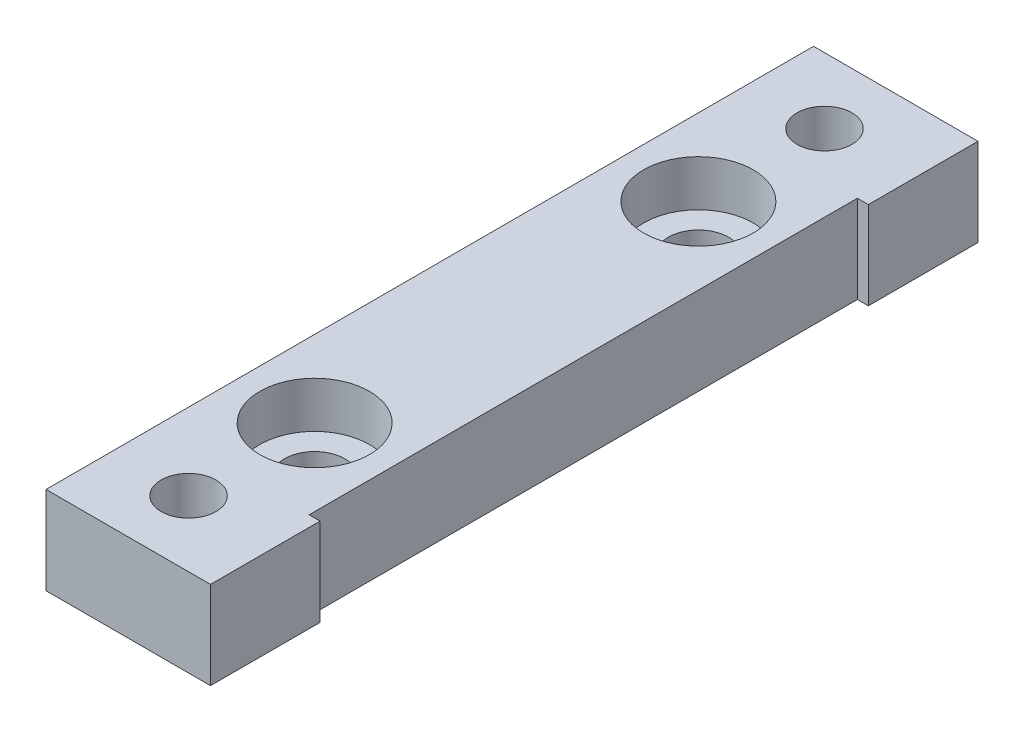
ISO-10303-21;
HEADER;
FILE_DESCRIPTION(('STEP AP214'),'2;1');
FILE_NAME('part.step','',(''),(''),'','','');
FILE_SCHEMA(('AUTOMOTIVE_DESIGN { 1 0 10303 214 1 1 1 1 }'));
ENDSEC;
DATA;
#1=APPLICATION_CONTEXT('core data for automotive mechanical design processes');
#2=APPLICATION_PROTOCOL_DEFINITION('international standard','automotive_design',2000,#1);
#3=PRODUCT_CONTEXT('',#1,'mechanical');
#4=PRODUCT('Part','Part','',(#3));
#5=PRODUCT_RELATED_PRODUCT_CATEGORY('part','',(#4));
#6=PRODUCT_DEFINITION_FORMATION('','',#4);
#7=PRODUCT_DEFINITION_CONTEXT('part definition',#1,'design');
#8=PRODUCT_DEFINITION('design','',#6,#7);
#9=PRODUCT_DEFINITION_SHAPE('','',#8);
#10=(LENGTH_UNIT() NAMED_UNIT(*) SI_UNIT(.MILLI.,.METRE.));
#11=(NAMED_UNIT(*) PLANE_ANGLE_UNIT() SI_UNIT($,.RADIAN.));
#12=(NAMED_UNIT(*) SI_UNIT($,.STERADIAN.) SOLID_ANGLE_UNIT());
#13=UNCERTAINTY_MEASURE_WITH_UNIT(LENGTH_MEASURE(1.E-05),#10,'distance_accuracy_value','');
#14=(GEOMETRIC_REPRESENTATION_CONTEXT(3) GLOBAL_UNCERTAINTY_ASSIGNED_CONTEXT((#13)) GLOBAL_UNIT_ASSIGNED_CONTEXT((#10,
#11,#12)) REPRESENTATION_CONTEXT('',''));
#15=CARTESIAN_POINT('',(0.,0.,0.));
#16=DIRECTION('',(0.,0.,1.));
#17=DIRECTION('',(1.,0.,0.));
#18=AXIS2_PLACEMENT_3D('',#15,#16,#17);
#19=CARTESIAN_POINT('',(-0.500000000000005,0.,-17.5));
#20=DIRECTION('',(0.,1.,0.));
#21=DIRECTION('',(0.,0.,1.));
#22=AXIS2_PLACEMENT_3D('',#19,#20,#21);
#23=CYLINDRICAL_SURFACE('',#22,2.75);
#24=CARTESIAN_POINT('',(-0.500000000000005,0.,-17.5));
#25=DIRECTION('',(0.,1.,0.));
#26=DIRECTION('',(0.,0.,1.));
#27=AXIS2_PLACEMENT_3D('',#24,#25,#26);
#28=CIRCLE('',#27,2.75);
#29=CARTESIAN_POINT('',(-0.500000000000005,0.,-14.75));
#30=VERTEX_POINT('',#29);
#31=EDGE_CURVE('E153',#30,#30,#28,.T.);
#32=ORIENTED_EDGE('',*,*,#31,.F.);
#33=EDGE_LOOP('',(#32));
#34=FACE_BOUND('',#33,.T.);
#35=CARTESIAN_POINT('',(-0.500000000000005,3.8,-17.5));
#36=DIRECTION('',(0.,1.,0.));
#37=DIRECTION('',(0.,0.,1.));
#38=AXIS2_PLACEMENT_3D('',#35,#36,#37);
#39=CIRCLE('',#38,2.75);
#40=CARTESIAN_POINT('',(-0.500000000000005,3.8,-14.75));
#41=VERTEX_POINT('',#40);
#42=EDGE_CURVE('E37',#41,#41,#39,.F.);
#43=ORIENTED_EDGE('',*,*,#42,.F.);
#44=EDGE_LOOP('',(#43));
#45=FACE_BOUND('',#44,.T.);
#46=ADVANCED_FACE('F33',(#34,#45),#23,.F.);
#47=CARTESIAN_POINT('',(-0.500000000000004,0.,17.5));
#48=DIRECTION('',(0.,1.,0.));
#49=DIRECTION('',(0.,0.,1.));
#50=AXIS2_PLACEMENT_3D('',#47,#48,#49);
#51=CYLINDRICAL_SURFACE('',#50,2.75);
#52=CARTESIAN_POINT('',(-0.500000000000004,0.,17.5));
#53=DIRECTION('',(0.,1.,0.));
#54=DIRECTION('',(0.,0.,1.));
#55=AXIS2_PLACEMENT_3D('',#52,#53,#54);
#56=CIRCLE('',#55,2.75);
#57=CARTESIAN_POINT('',(-0.500000000000004,0.,20.25));
#58=VERTEX_POINT('',#57);
#59=EDGE_CURVE('E168',#58,#58,#56,.T.);
#60=ORIENTED_EDGE('',*,*,#59,.F.);
#61=EDGE_LOOP('',(#60));
#62=FACE_BOUND('',#61,.T.);
#63=CARTESIAN_POINT('',(-0.500000000000004,3.8,17.5));
#64=DIRECTION('',(0.,1.,0.));
#65=DIRECTION('',(0.,0.,1.));
#66=AXIS2_PLACEMENT_3D('',#63,#64,#65);
#67=CIRCLE('',#66,2.75);
#68=CARTESIAN_POINT('',(-0.500000000000004,3.8,20.25));
#69=VERTEX_POINT('',#68);
#70=EDGE_CURVE('E147',#69,#69,#67,.F.);
#71=ORIENTED_EDGE('',*,*,#70,.F.);
#72=EDGE_LOOP('',(#71));
#73=FACE_BOUND('',#72,.T.);
#74=ADVANCED_FACE('F227',(#62,#73),#51,.F.);
#75=CARTESIAN_POINT('',(7.5,8.,-35.));
#76=DIRECTION('',(-1.,0.,0.));
#77=DIRECTION('',(0.,0.,1.));
#78=AXIS2_PLACEMENT_3D('',#75,#76,#77);
#79=PLANE('',#78);
#80=DIRECTION('',(0.,0.,-1.));
#81=VECTOR('',#80,1.);
#82=CARTESIAN_POINT('',(7.5,0.,-35.));
#83=LINE('',#82,#81);
#84=CARTESIAN_POINT('',(7.5,0.,35.));
#85=VERTEX_POINT('',#84);
#86=CARTESIAN_POINT('',(7.50000000000001,0.,25.));
#87=VERTEX_POINT('',#86);
#88=EDGE_CURVE('E128',#85,#87,#83,.T.);
#89=ORIENTED_EDGE('',*,*,#88,.T.);
#90=DIRECTION('',(0.,1.,0.));
#91=VECTOR('',#90,1.);
#92=CARTESIAN_POINT('',(7.50000000000001,0.,25.));
#93=LINE('',#92,#91);
#94=CARTESIAN_POINT('',(7.50000000000001,8.,25.));
#95=VERTEX_POINT('',#94);
#96=EDGE_CURVE('E129',#87,#95,#93,.T.);
#97=ORIENTED_EDGE('',*,*,#96,.T.);
#98=DIRECTION('',(0.,0.,-1.));
#99=VECTOR('',#98,1.);
#100=CARTESIAN_POINT('',(7.5,8.,-35.));
#101=LINE('',#100,#99);
#102=CARTESIAN_POINT('',(7.5,8.,35.));
#103=VERTEX_POINT('',#102);
#104=EDGE_CURVE('E196',#103,#95,#101,.T.);
#105=ORIENTED_EDGE('',*,*,#104,.F.);
#106=DIRECTION('',(0.,-1.,0.));
#107=VECTOR('',#106,1.);
#108=CARTESIAN_POINT('',(7.5,8.,35.));
#109=LINE('',#108,#107);
#110=EDGE_CURVE('E142',#103,#85,#109,.T.);
#111=ORIENTED_EDGE('',*,*,#110,.T.);
#112=EDGE_LOOP('',(#89,#97,#105,#111));
#113=FACE_BOUND('',#112,.T.);
#114=ADVANCED_FACE('F211',(#113),#79,.F.);
#115=CARTESIAN_POINT('',(7.5,8.,-25.));
#116=VERTEX_POINT('',#115);
#117=CARTESIAN_POINT('',(7.5,8.,-35.));
#118=VERTEX_POINT('',#117);
#119=EDGE_CURVE('E87',#116,#118,#101,.T.);
#120=ORIENTED_EDGE('',*,*,#119,.F.);
#121=DIRECTION('',(0.,1.,0.));
#122=VECTOR('',#121,1.);
#123=CARTESIAN_POINT('',(7.5,0.,-25.));
#124=LINE('',#123,#122);
#125=CARTESIAN_POINT('',(7.5,0.,-25.));
#126=VERTEX_POINT('',#125);
#127=EDGE_CURVE('E113',#126,#116,#124,.T.);
#128=ORIENTED_EDGE('',*,*,#127,.F.);
#129=CARTESIAN_POINT('',(7.5,0.,-35.));
#130=VERTEX_POINT('',#129);
#131=EDGE_CURVE('E121',#126,#130,#83,.T.);
#132=ORIENTED_EDGE('',*,*,#131,.T.);
#133=DIRECTION('',(0.,-1.,0.));
#134=VECTOR('',#133,1.);
#135=CARTESIAN_POINT('',(7.5,8.,-35.));
#136=LINE('',#135,#134);
#137=EDGE_CURVE('E11',#118,#130,#136,.T.);
#138=ORIENTED_EDGE('',*,*,#137,.F.);
#139=EDGE_LOOP('',(#120,#128,#132,#138));
#140=FACE_BOUND('',#139,.T.);
#141=ADVANCED_FACE('F35',(#140),#79,.F.);
#142=CARTESIAN_POINT('',(-7.5,8.,-35.));
#143=DIRECTION('',(0.,0.,1.));
#144=DIRECTION('',(1.,0.,0.));
#145=AXIS2_PLACEMENT_3D('',#142,#143,#144);
#146=PLANE('',#145);
#147=DIRECTION('',(-1.,0.,0.));
#148=VECTOR('',#147,1.);
#149=CARTESIAN_POINT('',(-7.5,0.,-35.));
#150=LINE('',#149,#148);
#151=CARTESIAN_POINT('',(-7.5,0.,-35.));
#152=VERTEX_POINT('',#151);
#153=EDGE_CURVE('E127',#130,#152,#150,.T.);
#154=ORIENTED_EDGE('',*,*,#153,.T.);
#155=DIRECTION('',(0.,-1.,0.));
#156=VECTOR('',#155,1.);
#157=CARTESIAN_POINT('',(-7.5,8.,-35.));
#158=LINE('',#157,#156);
#159=CARTESIAN_POINT('',(-7.5,8.,-35.));
#160=VERTEX_POINT('',#159);
#161=EDGE_CURVE('E42',#160,#152,#158,.T.);
#162=ORIENTED_EDGE('',*,*,#161,.F.);
#163=DIRECTION('',(-1.,0.,0.));
#164=VECTOR('',#163,1.);
#165=CARTESIAN_POINT('',(-7.5,8.,-35.));
#166=LINE('',#165,#164);
#167=EDGE_CURVE('E198',#118,#160,#166,.T.);
#168=ORIENTED_EDGE('',*,*,#167,.F.);
#169=ORIENTED_EDGE('',*,*,#137,.T.);
#170=EDGE_LOOP('',(#154,#162,#168,#169));
#171=FACE_BOUND('',#170,.T.);
#172=ADVANCED_FACE('F266',(#171),#146,.F.);
#173=CARTESIAN_POINT('',(-7.5,8.,-35.));
#174=DIRECTION('',(1.,0.,0.));
#175=DIRECTION('',(0.,0.,-1.));
#176=AXIS2_PLACEMENT_3D('',#173,#174,#175);
#177=PLANE('',#176);
#178=DIRECTION('',(0.,0.,1.));
#179=VECTOR('',#178,1.);
#180=CARTESIAN_POINT('',(-7.5,0.,-35.));
#181=LINE('',#180,#179);
#182=CARTESIAN_POINT('',(-7.5,0.,35.));
#183=VERTEX_POINT('',#182);
#184=EDGE_CURVE('E139',#152,#183,#181,.T.);
#185=ORIENTED_EDGE('',*,*,#184,.T.);
#186=DIRECTION('',(0.,-1.,0.));
#187=VECTOR('',#186,1.);
#188=CARTESIAN_POINT('',(-7.5,8.,35.));
#189=LINE('',#188,#187);
#190=CARTESIAN_POINT('',(-7.5,8.,35.));
#191=VERTEX_POINT('',#190);
#192=EDGE_CURVE('E144',#191,#183,#189,.T.);
#193=ORIENTED_EDGE('',*,*,#192,.F.);
#194=DIRECTION('',(0.,0.,1.));
#195=VECTOR('',#194,1.);
#196=CARTESIAN_POINT('',(-7.5,8.,-35.));
#197=LINE('',#196,#195);
#198=EDGE_CURVE('E199',#160,#191,#197,.T.);
#199=ORIENTED_EDGE('',*,*,#198,.F.);
#200=ORIENTED_EDGE('',*,*,#161,.T.);
#201=EDGE_LOOP('',(#185,#193,#199,#200));
#202=FACE_BOUND('',#201,.T.);
#203=ADVANCED_FACE('F206',(#202),#177,.F.);
#204=CARTESIAN_POINT('',(-7.5,8.,35.));
#205=DIRECTION('',(0.,0.,-1.));
#206=DIRECTION('',(-1.,0.,0.));
#207=AXIS2_PLACEMENT_3D('',#204,#205,#206);
#208=PLANE('',#207);
#209=DIRECTION('',(1.,0.,0.));
#210=VECTOR('',#209,1.);
#211=CARTESIAN_POINT('',(-7.5,0.,35.));
#212=LINE('',#211,#210);
#213=EDGE_CURVE('E80',#183,#85,#212,.T.);
#214=ORIENTED_EDGE('',*,*,#213,.T.);
#215=ORIENTED_EDGE('',*,*,#110,.F.);
#216=DIRECTION('',(1.,0.,0.));
#217=VECTOR('',#216,1.);
#218=CARTESIAN_POINT('',(-7.5,8.,35.));
#219=LINE('',#218,#217);
#220=EDGE_CURVE('E59',#191,#103,#219,.T.);
#221=ORIENTED_EDGE('',*,*,#220,.F.);
#222=ORIENTED_EDGE('',*,*,#192,.T.);
#223=EDGE_LOOP('',(#214,#215,#221,#222));
#224=FACE_BOUND('',#223,.T.);
#225=ADVANCED_FACE('F207',(#224),#208,.F.);
#226=CARTESIAN_POINT('',(0.,8.,0.));
#227=DIRECTION('',(0.,1.,0.));
#228=DIRECTION('',(0.,0.,1.));
#229=AXIS2_PLACEMENT_3D('',#226,#227,#228);
#230=PLANE('',#229);
#231=CARTESIAN_POINT('',(-0.500000000000005,8.,-17.5));
#232=DIRECTION('',(0.,1.,0.));
#233=DIRECTION('',(0.,0.,1.));
#234=AXIS2_PLACEMENT_3D('',#231,#232,#233);
#235=CIRCLE('',#234,5.);
#236=CARTESIAN_POINT('',(-0.500000000000005,8.,-12.5));
#237=VERTEX_POINT('',#236);
#238=EDGE_CURVE('E155',#237,#237,#235,.T.);
#239=ORIENTED_EDGE('',*,*,#238,.F.);
#240=EDGE_LOOP('',(#239));
#241=FACE_BOUND('',#240,.T.);
#242=CARTESIAN_POINT('',(-0.500000000000004,8.,17.5));
#243=DIRECTION('',(0.,1.,0.));
#244=DIRECTION('',(0.,0.,1.));
#245=AXIS2_PLACEMENT_3D('',#242,#243,#244);
#246=CIRCLE('',#245,5.);
#247=CARTESIAN_POINT('',(-0.500000000000004,8.,22.5));
#248=VERTEX_POINT('',#247);
#249=EDGE_CURVE('E165',#248,#248,#246,.T.);
#250=ORIENTED_EDGE('',*,*,#249,.F.);
#251=EDGE_LOOP('',(#250));
#252=FACE_BOUND('',#251,.T.);
#253=CARTESIAN_POINT('',(-0.500000000000004,8.,29.));
#254=DIRECTION('',(0.,1.,0.));
#255=DIRECTION('',(0.,0.,1.));
#256=AXIS2_PLACEMENT_3D('',#253,#254,#255);
#257=CIRCLE('',#256,2.5);
#258=CARTESIAN_POINT('',(-0.500000000000004,8.,31.5));
#259=VERTEX_POINT('',#258);
#260=EDGE_CURVE('E178',#259,#259,#257,.T.);
#261=ORIENTED_EDGE('',*,*,#260,.F.);
#262=EDGE_LOOP('',(#261));
#263=FACE_BOUND('',#262,.T.);
#264=CARTESIAN_POINT('',(-0.500000000000004,8.,-29.));
#265=DIRECTION('',(0.,1.,0.));
#266=DIRECTION('',(0.,0.,1.));
#267=AXIS2_PLACEMENT_3D('',#264,#265,#266);
#268=CIRCLE('',#267,2.5);
#269=CARTESIAN_POINT('',(-0.500000000000004,8.,-26.5));
#270=VERTEX_POINT('',#269);
#271=EDGE_CURVE('E171',#270,#270,#268,.T.);
#272=ORIENTED_EDGE('',*,*,#271,.F.);
#273=EDGE_LOOP('',(#272));
#274=FACE_BOUND('',#273,.T.);
#275=DIRECTION('',(1.,0.,0.));
#276=VECTOR('',#275,1.);
#277=CARTESIAN_POINT('',(7.50000000000001,8.,25.));
#278=LINE('',#277,#276);
#279=CARTESIAN_POINT('',(6.50000000000001,8.,25.));
#280=VERTEX_POINT('',#279);
#281=EDGE_CURVE('E117',#280,#95,#278,.T.);
#282=ORIENTED_EDGE('',*,*,#281,.F.);
#283=DIRECTION('',(0.,0.,1.));
#284=VECTOR('',#283,1.);
#285=CARTESIAN_POINT('',(6.5,8.,-25.));
#286=LINE('',#285,#284);
#287=CARTESIAN_POINT('',(6.5,8.,-25.));
#288=VERTEX_POINT('',#287);
#289=EDGE_CURVE('E190',#288,#280,#286,.T.);
#290=ORIENTED_EDGE('',*,*,#289,.F.);
#291=DIRECTION('',(-1.,0.,0.));
#292=VECTOR('',#291,1.);
#293=CARTESIAN_POINT('',(7.5,8.,-25.));
#294=LINE('',#293,#292);
#295=EDGE_CURVE('E177',#116,#288,#294,.T.);
#296=ORIENTED_EDGE('',*,*,#295,.F.);
#297=ORIENTED_EDGE('',*,*,#119,.T.);
#298=ORIENTED_EDGE('',*,*,#167,.T.);
#299=ORIENTED_EDGE('',*,*,#198,.T.);
#300=ORIENTED_EDGE('',*,*,#220,.T.);
#301=ORIENTED_EDGE('',*,*,#104,.T.);
#302=EDGE_LOOP('',(#282,#290,#296,#297,#298,#299,#300,#301));
#303=FACE_BOUND('',#302,.T.);
#304=ADVANCED_FACE('F203',(#241,#252,#263,#274,#303),#230,.T.);
#305=CARTESIAN_POINT('',(0.,0.,0.));
#306=DIRECTION('',(0.,1.,0.));
#307=DIRECTION('',(0.,0.,1.));
#308=AXIS2_PLACEMENT_3D('',#305,#306,#307);
#309=PLANE('',#308);
#310=ORIENTED_EDGE('',*,*,#59,.T.);
#311=EDGE_LOOP('',(#310));
#312=FACE_BOUND('',#311,.T.);
#313=ORIENTED_EDGE('',*,*,#31,.T.);
#314=EDGE_LOOP('',(#313));
#315=FACE_BOUND('',#314,.T.);
#316=CARTESIAN_POINT('',(-0.500000000000004,0.,29.));
#317=DIRECTION('',(0.,1.,0.));
#318=DIRECTION('',(0.,0.,1.));
#319=AXIS2_PLACEMENT_3D('',#316,#317,#318);
#320=CIRCLE('',#319,2.5);
#321=CARTESIAN_POINT('',(-0.500000000000004,0.,31.5));
#322=VERTEX_POINT('',#321);
#323=EDGE_CURVE('E174',#322,#322,#320,.T.);
#324=ORIENTED_EDGE('',*,*,#323,.T.);
#325=EDGE_LOOP('',(#324));
#326=FACE_BOUND('',#325,.T.);
#327=CARTESIAN_POINT('',(-0.500000000000004,0.,-29.));
#328=DIRECTION('',(0.,1.,0.));
#329=DIRECTION('',(0.,0.,1.));
#330=AXIS2_PLACEMENT_3D('',#327,#328,#329);
#331=CIRCLE('',#330,2.5);
#332=CARTESIAN_POINT('',(-0.500000000000004,0.,-26.5));
#333=VERTEX_POINT('',#332);
#334=EDGE_CURVE('E181',#333,#333,#331,.T.);
#335=ORIENTED_EDGE('',*,*,#334,.T.);
#336=EDGE_LOOP('',(#335));
#337=FACE_BOUND('',#336,.T.);
#338=DIRECTION('',(0.,0.,1.));
#339=VECTOR('',#338,1.);
#340=CARTESIAN_POINT('',(6.5,0.,-25.));
#341=LINE('',#340,#339);
#342=CARTESIAN_POINT('',(6.5,0.,-25.));
#343=VERTEX_POINT('',#342);
#344=CARTESIAN_POINT('',(6.50000000000001,0.,25.));
#345=VERTEX_POINT('',#344);
#346=EDGE_CURVE('E50',#343,#345,#341,.T.);
#347=ORIENTED_EDGE('',*,*,#346,.T.);
#348=DIRECTION('',(1.,0.,0.));
#349=VECTOR('',#348,1.);
#350=CARTESIAN_POINT('',(7.50000000000001,0.,25.));
#351=LINE('',#350,#349);
#352=EDGE_CURVE('E123',#345,#87,#351,.T.);
#353=ORIENTED_EDGE('',*,*,#352,.T.);
#354=ORIENTED_EDGE('',*,*,#88,.F.);
#355=ORIENTED_EDGE('',*,*,#213,.F.);
#356=ORIENTED_EDGE('',*,*,#184,.F.);
#357=ORIENTED_EDGE('',*,*,#153,.F.);
#358=ORIENTED_EDGE('',*,*,#131,.F.);
#359=DIRECTION('',(-1.,0.,0.));
#360=VECTOR('',#359,1.);
#361=CARTESIAN_POINT('',(7.5,0.,-25.));
#362=LINE('',#361,#360);
#363=EDGE_CURVE('E109',#126,#343,#362,.T.);
#364=ORIENTED_EDGE('',*,*,#363,.T.);
#365=EDGE_LOOP('',(#347,#353,#354,#355,#356,#357,#358,#364));
#366=FACE_BOUND('',#365,.T.);
#367=ADVANCED_FACE('F125',(#312,#315,#326,#337,#366),#309,.F.);
#368=CARTESIAN_POINT('',(7.50000000000001,0.,25.));
#369=DIRECTION('',(0.,0.,1.));
#370=DIRECTION('',(1.,0.,0.));
#371=AXIS2_PLACEMENT_3D('',#368,#369,#370);
#372=PLANE('',#371);
#373=ORIENTED_EDGE('',*,*,#281,.T.);
#374=ORIENTED_EDGE('',*,*,#96,.F.);
#375=ORIENTED_EDGE('',*,*,#352,.F.);
#376=DIRECTION('',(0.,1.,0.));
#377=VECTOR('',#376,1.);
#378=CARTESIAN_POINT('',(6.50000000000001,0.,25.));
#379=LINE('',#378,#377);
#380=EDGE_CURVE('E133',#345,#280,#379,.T.);
#381=ORIENTED_EDGE('',*,*,#380,.T.);
#382=EDGE_LOOP('',(#373,#374,#375,#381));
#383=FACE_BOUND('',#382,.T.);
#384=ADVANCED_FACE('F214',(#383),#372,.F.);
#385=CARTESIAN_POINT('',(6.5,0.,-25.));
#386=DIRECTION('',(-1.,0.,0.));
#387=DIRECTION('',(0.,0.,1.));
#388=AXIS2_PLACEMENT_3D('',#385,#386,#387);
#389=PLANE('',#388);
#390=ORIENTED_EDGE('',*,*,#289,.T.);
#391=ORIENTED_EDGE('',*,*,#380,.F.);
#392=ORIENTED_EDGE('',*,*,#346,.F.);
#393=DIRECTION('',(0.,1.,0.));
#394=VECTOR('',#393,1.);
#395=CARTESIAN_POINT('',(6.5,0.,-25.));
#396=LINE('',#395,#394);
#397=EDGE_CURVE('E114',#343,#288,#396,.T.);
#398=ORIENTED_EDGE('',*,*,#397,.T.);
#399=EDGE_LOOP('',(#390,#391,#392,#398));
#400=FACE_BOUND('',#399,.T.);
#401=ADVANCED_FACE('F216',(#400),#389,.F.);
#402=CARTESIAN_POINT('',(7.5,0.,-25.));
#403=DIRECTION('',(0.,0.,-1.));
#404=DIRECTION('',(-1.,0.,0.));
#405=AXIS2_PLACEMENT_3D('',#402,#403,#404);
#406=PLANE('',#405);
#407=ORIENTED_EDGE('',*,*,#295,.T.);
#408=ORIENTED_EDGE('',*,*,#397,.F.);
#409=ORIENTED_EDGE('',*,*,#363,.F.);
#410=ORIENTED_EDGE('',*,*,#127,.T.);
#411=EDGE_LOOP('',(#407,#408,#409,#410));
#412=FACE_BOUND('',#411,.T.);
#413=ADVANCED_FACE('F112',(#412),#406,.F.);
#414=CARTESIAN_POINT('',(-0.500000000000004,0.,-29.));
#415=DIRECTION('',(0.,1.,0.));
#416=DIRECTION('',(0.,0.,1.));
#417=AXIS2_PLACEMENT_3D('',#414,#415,#416);
#418=CYLINDRICAL_SURFACE('',#417,2.5);
#419=ORIENTED_EDGE('',*,*,#334,.F.);
#420=EDGE_LOOP('',(#419));
#421=FACE_BOUND('',#420,.T.);
#422=ORIENTED_EDGE('',*,*,#271,.T.);
#423=EDGE_LOOP('',(#422));
#424=FACE_BOUND('',#423,.T.);
#425=ADVANCED_FACE('F223',(#421,#424),#418,.F.);
#426=CARTESIAN_POINT('',(-0.500000000000004,0.,29.));
#427=DIRECTION('',(0.,1.,0.));
#428=DIRECTION('',(0.,0.,1.));
#429=AXIS2_PLACEMENT_3D('',#426,#427,#428);
#430=CYLINDRICAL_SURFACE('',#429,2.5);
#431=ORIENTED_EDGE('',*,*,#323,.F.);
#432=EDGE_LOOP('',(#431));
#433=FACE_BOUND('',#432,.T.);
#434=ORIENTED_EDGE('',*,*,#260,.T.);
#435=EDGE_LOOP('',(#434));
#436=FACE_BOUND('',#435,.T.);
#437=ADVANCED_FACE('F239',(#433,#436),#430,.F.);
#438=CARTESIAN_POINT('',(-0.500000000000004,3.8,17.5));
#439=DIRECTION('',(0.,1.,0.));
#440=DIRECTION('',(0.,0.,1.));
#441=AXIS2_PLACEMENT_3D('',#438,#439,#440);
#442=PLANE('',#441);
#443=CARTESIAN_POINT('',(-0.500000000000004,3.8,17.5));
#444=DIRECTION('',(0.,1.,0.));
#445=DIRECTION('',(0.,0.,1.));
#446=AXIS2_PLACEMENT_3D('',#443,#444,#445);
#447=CIRCLE('',#446,5.);
#448=CARTESIAN_POINT('',(-0.500000000000004,3.8,22.5));
#449=VERTEX_POINT('',#448);
#450=EDGE_CURVE('E160',#449,#449,#447,.T.);
#451=ORIENTED_EDGE('',*,*,#450,.T.);
#452=EDGE_LOOP('',(#451));
#453=FACE_BOUND('',#452,.T.);
#454=ORIENTED_EDGE('',*,*,#70,.T.);
#455=EDGE_LOOP('',(#454));
#456=FACE_BOUND('',#455,.T.);
#457=ADVANCED_FACE('F242',(#453,#456),#442,.T.);
#458=CARTESIAN_POINT('',(-0.500000000000004,3.8,17.5));
#459=DIRECTION('',(0.,1.,0.));
#460=DIRECTION('',(0.,0.,1.));
#461=AXIS2_PLACEMENT_3D('',#458,#459,#460);
#462=CYLINDRICAL_SURFACE('',#461,5.);
#463=ORIENTED_EDGE('',*,*,#450,.F.);
#464=EDGE_LOOP('',(#463));
#465=FACE_BOUND('',#464,.T.);
#466=ORIENTED_EDGE('',*,*,#249,.T.);
#467=EDGE_LOOP('',(#466));
#468=FACE_BOUND('',#467,.T.);
#469=ADVANCED_FACE('F301',(#465,#468),#462,.F.);
#470=CARTESIAN_POINT('',(-0.500000000000005,3.8,-17.5));
#471=DIRECTION('',(0.,1.,0.));
#472=DIRECTION('',(0.,0.,1.));
#473=AXIS2_PLACEMENT_3D('',#470,#471,#472);
#474=PLANE('',#473);
#475=CARTESIAN_POINT('',(-0.500000000000005,3.8,-17.5));
#476=DIRECTION('',(0.,1.,0.));
#477=DIRECTION('',(0.,0.,1.));
#478=AXIS2_PLACEMENT_3D('',#475,#476,#477);
#479=CIRCLE('',#478,5.);
#480=CARTESIAN_POINT('',(-0.500000000000005,3.8,-12.5));
#481=VERTEX_POINT('',#480);
#482=EDGE_CURVE('E149',#481,#481,#479,.T.);
#483=ORIENTED_EDGE('',*,*,#482,.T.);
#484=EDGE_LOOP('',(#483));
#485=FACE_BOUND('',#484,.T.);
#486=ORIENTED_EDGE('',*,*,#42,.T.);
#487=EDGE_LOOP('',(#486));
#488=FACE_BOUND('',#487,.T.);
#489=ADVANCED_FACE('F311',(#485,#488),#474,.T.);
#490=CARTESIAN_POINT('',(-0.500000000000005,3.8,-17.5));
#491=DIRECTION('',(0.,1.,0.));
#492=DIRECTION('',(0.,0.,1.));
#493=AXIS2_PLACEMENT_3D('',#490,#491,#492);
#494=CYLINDRICAL_SURFACE('',#493,5.);
#495=ORIENTED_EDGE('',*,*,#482,.F.);
#496=EDGE_LOOP('',(#495));
#497=FACE_BOUND('',#496,.T.);
#498=ORIENTED_EDGE('',*,*,#238,.T.);
#499=EDGE_LOOP('',(#498));
#500=FACE_BOUND('',#499,.T.);
#501=ADVANCED_FACE('F320',(#497,#500),#494,.F.);
#502=CLOSED_SHELL('',(#46,#74,#114,#141,#172,#203,#225,#304,#367,#384,#401,#413,#425,#437,#457,
#469,#489,#501));
#503=MANIFOLD_SOLID_BREP('B2',#502);
#504=ADVANCED_BREP_SHAPE_REPRESENTATION('',(#18,#503),#14);
#505=SHAPE_DEFINITION_REPRESENTATION(#9,#504);
ENDSEC;
END-ISO-10303-21;
